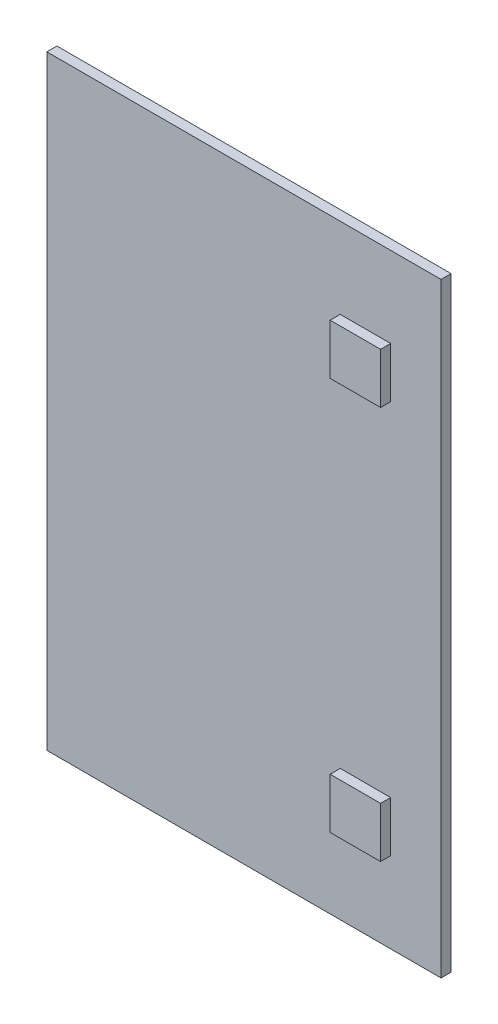
ISO-10303-21;
HEADER;
FILE_DESCRIPTION(('STEP AP214'),'2;1');
FILE_NAME('part.step','',(''),(''),'','','');
FILE_SCHEMA(('AUTOMOTIVE_DESIGN { 1 0 10303 214 1 1 1 1 }'));
ENDSEC;
DATA;
#1=APPLICATION_CONTEXT('core data for automotive mechanical design processes');
#2=APPLICATION_PROTOCOL_DEFINITION('international standard','automotive_design',2000,#1);
#3=PRODUCT_CONTEXT('',#1,'mechanical');
#4=PRODUCT('Part','Part','',(#3));
#5=PRODUCT_RELATED_PRODUCT_CATEGORY('part','',(#4));
#6=PRODUCT_DEFINITION_FORMATION('','',#4);
#7=PRODUCT_DEFINITION_CONTEXT('part definition',#1,'design');
#8=PRODUCT_DEFINITION('design','',#6,#7);
#9=PRODUCT_DEFINITION_SHAPE('','',#8);
#10=(LENGTH_UNIT() NAMED_UNIT(*) SI_UNIT(.MILLI.,.METRE.));
#11=(NAMED_UNIT(*) PLANE_ANGLE_UNIT() SI_UNIT($,.RADIAN.));
#12=(NAMED_UNIT(*) SI_UNIT($,.STERADIAN.) SOLID_ANGLE_UNIT());
#13=UNCERTAINTY_MEASURE_WITH_UNIT(LENGTH_MEASURE(1.E-05),#10,'distance_accuracy_value','');
#14=(GEOMETRIC_REPRESENTATION_CONTEXT(3) GLOBAL_UNCERTAINTY_ASSIGNED_CONTEXT((#13)) GLOBAL_UNIT_ASSIGNED_CONTEXT((#10,
#11,#12)) REPRESENTATION_CONTEXT('',''));
#15=CARTESIAN_POINT('',(0.,0.,0.));
#16=DIRECTION('',(0.,0.,1.));
#17=DIRECTION('',(1.,0.,0.));
#18=AXIS2_PLACEMENT_3D('',#15,#16,#17);
#19=CARTESIAN_POINT('',(0.,0.,0.));
#20=DIRECTION('',(0.,0.,1.));
#21=DIRECTION('',(1.,0.,0.));
#22=AXIS2_PLACEMENT_3D('',#19,#20,#21);
#23=PLANE('',#22);
#24=DIRECTION('',(1.,0.,0.));
#25=VECTOR('',#24,1.);
#26=CARTESIAN_POINT('',(-118.594107130853,469.546616829378,0.));
#27=LINE('',#26,#25);
#28=CARTESIAN_POINT('',(-118.594107130853,469.546616829378,0.));
#29=VERTEX_POINT('',#28);
#30=CARTESIAN_POINT('',(-68.594107130853,469.546616829378,0.));
#31=VERTEX_POINT('',#30);
#32=EDGE_CURVE('E152',#29,#31,#27,.T.);
#33=ORIENTED_EDGE('',*,*,#32,.F.);
#34=DIRECTION('',(0.,-1.,0.));
#35=VECTOR('',#34,1.);
#36=CARTESIAN_POINT('',(-118.594107130853,519.546616829378,0.));
#37=LINE('',#36,#35);
#38=CARTESIAN_POINT('',(-118.594107130853,519.546616829378,0.));
#39=VERTEX_POINT('',#38);
#40=EDGE_CURVE('E149',#39,#29,#37,.T.);
#41=ORIENTED_EDGE('',*,*,#40,.F.);
#42=DIRECTION('',(-1.,0.,0.));
#43=VECTOR('',#42,1.);
#44=CARTESIAN_POINT('',(-118.594107130853,519.546616829378,0.));
#45=LINE('',#44,#43);
#46=CARTESIAN_POINT('',(-68.594107130853,519.546616829378,0.));
#47=VERTEX_POINT('',#46);
#48=EDGE_CURVE('E161',#47,#39,#45,.T.);
#49=ORIENTED_EDGE('',*,*,#48,.F.);
#50=DIRECTION('',(0.,1.,0.));
#51=VECTOR('',#50,1.);
#52=CARTESIAN_POINT('',(-68.594107130853,519.546616829378,0.));
#53=LINE('',#52,#51);
#54=EDGE_CURVE('E169',#31,#47,#53,.T.);
#55=ORIENTED_EDGE('',*,*,#54,.F.);
#56=EDGE_LOOP('',(#33,#41,#49,#55));
#57=FACE_BOUND('',#56,.T.);
#58=DIRECTION('',(0.,1.,0.));
#59=VECTOR('',#58,1.);
#60=CARTESIAN_POINT('',(-18.594107130853,-0.453383170622331,0.));
#61=LINE('',#60,#59);
#62=CARTESIAN_POINT('',(-18.594107130853,-0.453383170622331,0.));
#63=VERTEX_POINT('',#62);
#64=CARTESIAN_POINT('',(-18.594107130853,599.546616829378,0.));
#65=VERTEX_POINT('',#64);
#66=EDGE_CURVE('E180',#63,#65,#61,.T.);
#67=ORIENTED_EDGE('',*,*,#66,.T.);
#68=DIRECTION('',(-1.,0.,0.));
#69=VECTOR('',#68,1.);
#70=CARTESIAN_POINT('',(-18.594107130853,599.546616829378,0.));
#71=LINE('',#70,#69);
#72=CARTESIAN_POINT('',(-409.594107130853,599.546616829378,0.));
#73=VERTEX_POINT('',#72);
#74=EDGE_CURVE('E196',#65,#73,#71,.T.);
#75=ORIENTED_EDGE('',*,*,#74,.T.);
#76=DIRECTION('',(0.,-1.,0.));
#77=VECTOR('',#76,1.);
#78=CARTESIAN_POINT('',(-409.594107130853,-0.453383170622379,0.));
#79=LINE('',#78,#77);
#80=CARTESIAN_POINT('',(-409.594107130853,-0.453383170622379,0.));
#81=VERTEX_POINT('',#80);
#82=EDGE_CURVE('E199',#73,#81,#79,.T.);
#83=ORIENTED_EDGE('',*,*,#82,.T.);
#84=DIRECTION('',(1.,0.,0.));
#85=VECTOR('',#84,1.);
#86=CARTESIAN_POINT('',(-18.594107130853,-0.453383170622331,0.));
#87=LINE('',#86,#85);
#88=EDGE_CURVE('E185',#81,#63,#87,.T.);
#89=ORIENTED_EDGE('',*,*,#88,.T.);
#90=EDGE_LOOP('',(#67,#75,#83,#89));
#91=FACE_BOUND('',#90,.T.);
#92=DIRECTION('',(1.,0.,0.));
#93=VECTOR('',#92,1.);
#94=CARTESIAN_POINT('',(-118.594107130853,79.5466168293776,0.));
#95=LINE('',#94,#93);
#96=CARTESIAN_POINT('',(-118.594107130853,79.5466168293776,0.));
#97=VERTEX_POINT('',#96);
#98=CARTESIAN_POINT('',(-68.5941071308529,79.5466168293776,0.));
#99=VERTEX_POINT('',#98);
#100=EDGE_CURVE('E370',#97,#99,#95,.T.);
#101=ORIENTED_EDGE('',*,*,#100,.F.);
#102=DIRECTION('',(0.,-1.,0.));
#103=VECTOR('',#102,1.);
#104=CARTESIAN_POINT('',(-118.594107130853,129.546616829378,0.));
#105=LINE('',#104,#103);
#106=CARTESIAN_POINT('',(-118.594107130853,129.546616829378,0.));
#107=VERTEX_POINT('',#106);
#108=EDGE_CURVE('E147',#107,#97,#105,.T.);
#109=ORIENTED_EDGE('',*,*,#108,.F.);
#110=DIRECTION('',(-1.,0.,0.));
#111=VECTOR('',#110,1.);
#112=CARTESIAN_POINT('',(-118.594107130853,129.546616829378,0.));
#113=LINE('',#112,#111);
#114=CARTESIAN_POINT('',(-68.5941071308529,129.546616829378,0.));
#115=VERTEX_POINT('',#114);
#116=EDGE_CURVE('E143',#115,#107,#113,.T.);
#117=ORIENTED_EDGE('',*,*,#116,.F.);
#118=DIRECTION('',(0.,1.,0.));
#119=VECTOR('',#118,1.);
#120=CARTESIAN_POINT('',(-68.5941071308529,129.546616829378,0.));
#121=LINE('',#120,#119);
#122=EDGE_CURVE('E367',#99,#115,#121,.T.);
#123=ORIENTED_EDGE('',*,*,#122,.F.);
#124=EDGE_LOOP('',(#101,#109,#117,#123));
#125=FACE_BOUND('',#124,.T.);
#126=ADVANCED_FACE('F33',(#57,#91,#125),#23,.T.);
#127=CARTESIAN_POINT('',(-18.594107130853,-0.453383170622331,-10.));
#128=DIRECTION('',(1.,0.,0.));
#129=DIRECTION('',(0.,0.,-1.));
#130=AXIS2_PLACEMENT_3D('',#127,#128,#129);
#131=PLANE('',#130);
#132=ORIENTED_EDGE('',*,*,#66,.F.);
#133=DIRECTION('',(0.,0.,1.));
#134=VECTOR('',#133,1.);
#135=CARTESIAN_POINT('',(-18.594107130853,-0.453383170622331,-10.));
#136=LINE('',#135,#134);
#137=CARTESIAN_POINT('',(-18.594107130853,-0.453383170622331,-10.));
#138=VERTEX_POINT('',#137);
#139=EDGE_CURVE('E11',#138,#63,#136,.T.);
#140=ORIENTED_EDGE('',*,*,#139,.F.);
#141=DIRECTION('',(0.,1.,0.));
#142=VECTOR('',#141,1.);
#143=CARTESIAN_POINT('',(-18.594107130853,-0.453383170622331,-10.));
#144=LINE('',#143,#142);
#145=CARTESIAN_POINT('',(-18.594107130853,599.546616829378,-10.));
#146=VERTEX_POINT('',#145);
#147=EDGE_CURVE('E181',#138,#146,#144,.T.);
#148=ORIENTED_EDGE('',*,*,#147,.T.);
#149=DIRECTION('',(0.,0.,1.));
#150=VECTOR('',#149,1.);
#151=CARTESIAN_POINT('',(-18.594107130853,599.546616829378,-10.));
#152=LINE('',#151,#150);
#153=EDGE_CURVE('E37',#146,#65,#152,.T.);
#154=ORIENTED_EDGE('',*,*,#153,.T.);
#155=EDGE_LOOP('',(#132,#140,#148,#154));
#156=FACE_BOUND('',#155,.T.);
#157=ADVANCED_FACE('F35',(#156),#131,.T.);
#158=CARTESIAN_POINT('',(-18.594107130853,-0.453383170622331,-10.));
#159=DIRECTION('',(0.,-1.,0.));
#160=DIRECTION('',(1.,0.,0.));
#161=AXIS2_PLACEMENT_3D('',#158,#159,#160);
#162=PLANE('',#161);
#163=ORIENTED_EDGE('',*,*,#88,.F.);
#164=DIRECTION('',(0.,0.,1.));
#165=VECTOR('',#164,1.);
#166=CARTESIAN_POINT('',(-409.594107130853,-0.453383170622379,-10.));
#167=LINE('',#166,#165);
#168=CARTESIAN_POINT('',(-409.594107130853,-0.453383170622379,-10.));
#169=VERTEX_POINT('',#168);
#170=EDGE_CURVE('E42',#169,#81,#167,.T.);
#171=ORIENTED_EDGE('',*,*,#170,.F.);
#172=DIRECTION('',(1.,0.,0.));
#173=VECTOR('',#172,1.);
#174=CARTESIAN_POINT('',(-18.594107130853,-0.453383170622331,-10.));
#175=LINE('',#174,#173);
#176=EDGE_CURVE('E191',#169,#138,#175,.T.);
#177=ORIENTED_EDGE('',*,*,#176,.T.);
#178=ORIENTED_EDGE('',*,*,#139,.T.);
#179=EDGE_LOOP('',(#163,#171,#177,#178));
#180=FACE_BOUND('',#179,.T.);
#181=ADVANCED_FACE('F217',(#180),#162,.T.);
#182=CARTESIAN_POINT('',(-409.594107130853,-0.453383170622379,-10.));
#183=DIRECTION('',(-1.,0.,0.));
#184=DIRECTION('',(0.,-1.,0.));
#185=AXIS2_PLACEMENT_3D('',#182,#183,#184);
#186=PLANE('',#185);
#187=ORIENTED_EDGE('',*,*,#82,.F.);
#188=DIRECTION('',(0.,0.,1.));
#189=VECTOR('',#188,1.);
#190=CARTESIAN_POINT('',(-409.594107130853,599.546616829378,-10.));
#191=LINE('',#190,#189);
#192=CARTESIAN_POINT('',(-409.594107130853,599.546616829378,-10.));
#193=VERTEX_POINT('',#192);
#194=EDGE_CURVE('E204',#193,#73,#191,.T.);
#195=ORIENTED_EDGE('',*,*,#194,.F.);
#196=DIRECTION('',(0.,-1.,0.));
#197=VECTOR('',#196,1.);
#198=CARTESIAN_POINT('',(-409.594107130853,-0.453383170622379,-10.));
#199=LINE('',#198,#197);
#200=EDGE_CURVE('E188',#193,#169,#199,.T.);
#201=ORIENTED_EDGE('',*,*,#200,.T.);
#202=ORIENTED_EDGE('',*,*,#170,.T.);
#203=EDGE_LOOP('',(#187,#195,#201,#202));
#204=FACE_BOUND('',#203,.T.);
#205=ADVANCED_FACE('F223',(#204),#186,.T.);
#206=CARTESIAN_POINT('',(-18.594107130853,599.546616829378,-10.));
#207=DIRECTION('',(0.,1.,0.));
#208=DIRECTION('',(-1.,0.,0.));
#209=AXIS2_PLACEMENT_3D('',#206,#207,#208);
#210=PLANE('',#209);
#211=ORIENTED_EDGE('',*,*,#74,.F.);
#212=ORIENTED_EDGE('',*,*,#153,.F.);
#213=DIRECTION('',(-1.,0.,0.));
#214=VECTOR('',#213,1.);
#215=CARTESIAN_POINT('',(-18.594107130853,599.546616829378,-10.));
#216=LINE('',#215,#214);
#217=EDGE_CURVE('E184',#146,#193,#216,.T.);
#218=ORIENTED_EDGE('',*,*,#217,.T.);
#219=ORIENTED_EDGE('',*,*,#194,.T.);
#220=EDGE_LOOP('',(#211,#212,#218,#219));
#221=FACE_BOUND('',#220,.T.);
#222=ADVANCED_FACE('F212',(#221),#210,.T.);
#223=CARTESIAN_POINT('',(0.,0.,-10.));
#224=DIRECTION('',(0.,0.,1.));
#225=DIRECTION('',(1.,0.,0.));
#226=AXIS2_PLACEMENT_3D('',#223,#224,#225);
#227=PLANE('',#226);
#228=ORIENTED_EDGE('',*,*,#147,.F.);
#229=ORIENTED_EDGE('',*,*,#176,.F.);
#230=ORIENTED_EDGE('',*,*,#200,.F.);
#231=ORIENTED_EDGE('',*,*,#217,.F.);
#232=EDGE_LOOP('',(#228,#229,#230,#231));
#233=FACE_BOUND('',#232,.T.);
#234=ADVANCED_FACE('F220',(#233),#227,.F.);
#235=CARTESIAN_POINT('',(-118.594107130853,519.546616829378,10.));
#236=DIRECTION('',(1.,0.,0.));
#237=DIRECTION('',(0.,0.,-1.));
#238=AXIS2_PLACEMENT_3D('',#235,#236,#237);
#239=PLANE('',#238);
#240=ORIENTED_EDGE('',*,*,#40,.T.);
#241=DIRECTION('',(0.,0.,-1.));
#242=VECTOR('',#241,1.);
#243=CARTESIAN_POINT('',(-118.594107130853,469.546616829378,10.));
#244=LINE('',#243,#242);
#245=CARTESIAN_POINT('',(-118.594107130853,469.546616829378,10.));
#246=VERTEX_POINT('',#245);
#247=EDGE_CURVE('E178',#246,#29,#244,.T.);
#248=ORIENTED_EDGE('',*,*,#247,.F.);
#249=DIRECTION('',(0.,-1.,0.));
#250=VECTOR('',#249,1.);
#251=CARTESIAN_POINT('',(-118.594107130853,519.546616829378,10.));
#252=LINE('',#251,#250);
#253=CARTESIAN_POINT('',(-118.594107130853,519.546616829378,10.));
#254=VERTEX_POINT('',#253);
#255=EDGE_CURVE('E157',#254,#246,#252,.T.);
#256=ORIENTED_EDGE('',*,*,#255,.F.);
#257=DIRECTION('',(0.,0.,-1.));
#258=VECTOR('',#257,1.);
#259=CARTESIAN_POINT('',(-118.594107130853,519.546616829378,10.));
#260=LINE('',#259,#258);
#261=EDGE_CURVE('E166',#254,#39,#260,.T.);
#262=ORIENTED_EDGE('',*,*,#261,.T.);
#263=EDGE_LOOP('',(#240,#248,#256,#262));
#264=FACE_BOUND('',#263,.T.);
#265=ADVANCED_FACE('F243',(#264),#239,.F.);
#266=CARTESIAN_POINT('',(-118.594107130853,469.546616829378,10.));
#267=DIRECTION('',(0.,1.,0.));
#268=DIRECTION('',(-1.,0.,0.));
#269=AXIS2_PLACEMENT_3D('',#266,#267,#268);
#270=PLANE('',#269);
#271=ORIENTED_EDGE('',*,*,#32,.T.);
#272=DIRECTION('',(0.,0.,-1.));
#273=VECTOR('',#272,1.);
#274=CARTESIAN_POINT('',(-68.594107130853,469.546616829378,10.));
#275=LINE('',#274,#273);
#276=CARTESIAN_POINT('',(-68.594107130853,469.546616829378,10.));
#277=VERTEX_POINT('',#276);
#278=EDGE_CURVE('E175',#277,#31,#275,.T.);
#279=ORIENTED_EDGE('',*,*,#278,.F.);
#280=DIRECTION('',(1.,0.,0.));
#281=VECTOR('',#280,1.);
#282=CARTESIAN_POINT('',(-118.594107130853,469.546616829378,10.));
#283=LINE('',#282,#281);
#284=EDGE_CURVE('E160',#246,#277,#283,.T.);
#285=ORIENTED_EDGE('',*,*,#284,.F.);
#286=ORIENTED_EDGE('',*,*,#247,.T.);
#287=EDGE_LOOP('',(#271,#279,#285,#286));
#288=FACE_BOUND('',#287,.T.);
#289=ADVANCED_FACE('F246',(#288),#270,.F.);
#290=CARTESIAN_POINT('',(-68.594107130853,519.546616829378,10.));
#291=DIRECTION('',(-1.,0.,0.));
#292=DIRECTION('',(0.,0.,1.));
#293=AXIS2_PLACEMENT_3D('',#290,#291,#292);
#294=PLANE('',#293);
#295=ORIENTED_EDGE('',*,*,#54,.T.);
#296=DIRECTION('',(0.,0.,-1.));
#297=VECTOR('',#296,1.);
#298=CARTESIAN_POINT('',(-68.594107130853,519.546616829378,10.));
#299=LINE('',#298,#297);
#300=CARTESIAN_POINT('',(-68.594107130853,519.546616829378,10.));
#301=VERTEX_POINT('',#300);
#302=EDGE_CURVE('E58',#301,#47,#299,.T.);
#303=ORIENTED_EDGE('',*,*,#302,.F.);
#304=DIRECTION('',(0.,1.,0.));
#305=VECTOR('',#304,1.);
#306=CARTESIAN_POINT('',(-68.594107130853,519.546616829378,10.));
#307=LINE('',#306,#305);
#308=EDGE_CURVE('E163',#277,#301,#307,.T.);
#309=ORIENTED_EDGE('',*,*,#308,.F.);
#310=ORIENTED_EDGE('',*,*,#278,.T.);
#311=EDGE_LOOP('',(#295,#303,#309,#310));
#312=FACE_BOUND('',#311,.T.);
#313=ADVANCED_FACE('F250',(#312),#294,.F.);
#314=CARTESIAN_POINT('',(-118.594107130853,519.546616829378,10.));
#315=DIRECTION('',(0.,-1.,0.));
#316=DIRECTION('',(0.,0.,-1.));
#317=AXIS2_PLACEMENT_3D('',#314,#315,#316);
#318=PLANE('',#317);
#319=ORIENTED_EDGE('',*,*,#48,.T.);
#320=ORIENTED_EDGE('',*,*,#261,.F.);
#321=DIRECTION('',(-1.,0.,0.));
#322=VECTOR('',#321,1.);
#323=CARTESIAN_POINT('',(-118.594107130853,519.546616829378,10.));
#324=LINE('',#323,#322);
#325=EDGE_CURVE('E165',#301,#254,#324,.T.);
#326=ORIENTED_EDGE('',*,*,#325,.F.);
#327=ORIENTED_EDGE('',*,*,#302,.T.);
#328=EDGE_LOOP('',(#319,#320,#326,#327));
#329=FACE_BOUND('',#328,.T.);
#330=ADVANCED_FACE('F254',(#329),#318,.F.);
#331=CARTESIAN_POINT('',(0.,0.,10.));
#332=DIRECTION('',(0.,0.,1.));
#333=DIRECTION('',(1.,0.,0.));
#334=AXIS2_PLACEMENT_3D('',#331,#332,#333);
#335=PLANE('',#334);
#336=ORIENTED_EDGE('',*,*,#255,.T.);
#337=ORIENTED_EDGE('',*,*,#284,.T.);
#338=ORIENTED_EDGE('',*,*,#308,.T.);
#339=ORIENTED_EDGE('',*,*,#325,.T.);
#340=EDGE_LOOP('',(#336,#337,#338,#339));
#341=FACE_BOUND('',#340,.T.);
#342=ADVANCED_FACE('F258',(#341),#335,.T.);
#343=CARTESIAN_POINT('',(-118.594107130853,129.546616829378,10.));
#344=DIRECTION('',(1.,0.,0.));
#345=DIRECTION('',(0.,0.,-1.));
#346=AXIS2_PLACEMENT_3D('',#343,#344,#345);
#347=PLANE('',#346);
#348=ORIENTED_EDGE('',*,*,#108,.T.);
#349=DIRECTION('',(0.,0.,-1.));
#350=VECTOR('',#349,1.);
#351=CARTESIAN_POINT('',(-118.594107130853,79.5466168293776,10.));
#352=LINE('',#351,#350);
#353=CARTESIAN_POINT('',(-118.594107130853,79.5466168293776,10.));
#354=VERTEX_POINT('',#353);
#355=EDGE_CURVE('E128',#354,#97,#352,.T.);
#356=ORIENTED_EDGE('',*,*,#355,.F.);
#357=DIRECTION('',(0.,-1.,0.));
#358=VECTOR('',#357,1.);
#359=CARTESIAN_POINT('',(-118.594107130853,129.546616829378,10.));
#360=LINE('',#359,#358);
#361=CARTESIAN_POINT('',(-118.594107130853,129.546616829378,10.));
#362=VERTEX_POINT('',#361);
#363=EDGE_CURVE('E135',#362,#354,#360,.T.);
#364=ORIENTED_EDGE('',*,*,#363,.F.);
#365=DIRECTION('',(0.,0.,-1.));
#366=VECTOR('',#365,1.);
#367=CARTESIAN_POINT('',(-118.594107130853,129.546616829378,10.));
#368=LINE('',#367,#366);
#369=EDGE_CURVE('E365',#362,#107,#368,.T.);
#370=ORIENTED_EDGE('',*,*,#369,.T.);
#371=EDGE_LOOP('',(#348,#356,#364,#370));
#372=FACE_BOUND('',#371,.T.);
#373=ADVANCED_FACE('F145',(#372),#347,.F.);
#374=CARTESIAN_POINT('',(-118.594107130853,79.5466168293776,10.));
#375=DIRECTION('',(0.,1.,0.));
#376=DIRECTION('',(0.,0.,1.));
#377=AXIS2_PLACEMENT_3D('',#374,#375,#376);
#378=PLANE('',#377);
#379=ORIENTED_EDGE('',*,*,#100,.T.);
#380=DIRECTION('',(0.,0.,-1.));
#381=VECTOR('',#380,1.);
#382=CARTESIAN_POINT('',(-68.5941071308529,79.5466168293776,10.));
#383=LINE('',#382,#381);
#384=CARTESIAN_POINT('',(-68.5941071308529,79.5466168293776,10.));
#385=VERTEX_POINT('',#384);
#386=EDGE_CURVE('E131',#385,#99,#383,.T.);
#387=ORIENTED_EDGE('',*,*,#386,.F.);
#388=DIRECTION('',(1.,0.,0.));
#389=VECTOR('',#388,1.);
#390=CARTESIAN_POINT('',(-118.594107130853,79.5466168293776,10.));
#391=LINE('',#390,#389);
#392=EDGE_CURVE('E124',#354,#385,#391,.T.);
#393=ORIENTED_EDGE('',*,*,#392,.F.);
#394=ORIENTED_EDGE('',*,*,#355,.T.);
#395=EDGE_LOOP('',(#379,#387,#393,#394));
#396=FACE_BOUND('',#395,.T.);
#397=ADVANCED_FACE('F126',(#396),#378,.F.);
#398=CARTESIAN_POINT('',(-68.5941071308529,129.546616829378,10.));
#399=DIRECTION('',(-1.,0.,0.));
#400=DIRECTION('',(0.,0.,1.));
#401=AXIS2_PLACEMENT_3D('',#398,#399,#400);
#402=PLANE('',#401);
#403=ORIENTED_EDGE('',*,*,#122,.T.);
#404=DIRECTION('',(0.,0.,-1.));
#405=VECTOR('',#404,1.);
#406=CARTESIAN_POINT('',(-68.5941071308529,129.546616829378,10.));
#407=LINE('',#406,#405);
#408=CARTESIAN_POINT('',(-68.5941071308529,129.546616829378,10.));
#409=VERTEX_POINT('',#408);
#410=EDGE_CURVE('E50',#409,#115,#407,.T.);
#411=ORIENTED_EDGE('',*,*,#410,.F.);
#412=DIRECTION('',(0.,1.,0.));
#413=VECTOR('',#412,1.);
#414=CARTESIAN_POINT('',(-68.5941071308529,129.546616829378,10.));
#415=LINE('',#414,#413);
#416=EDGE_CURVE('E134',#385,#409,#415,.T.);
#417=ORIENTED_EDGE('',*,*,#416,.F.);
#418=ORIENTED_EDGE('',*,*,#386,.T.);
#419=EDGE_LOOP('',(#403,#411,#417,#418));
#420=FACE_BOUND('',#419,.T.);
#421=ADVANCED_FACE('F266',(#420),#402,.F.);
#422=CARTESIAN_POINT('',(-118.594107130853,129.546616829378,10.));
#423=DIRECTION('',(0.,-1.,0.));
#424=DIRECTION('',(1.,0.,0.));
#425=AXIS2_PLACEMENT_3D('',#422,#423,#424);
#426=PLANE('',#425);
#427=ORIENTED_EDGE('',*,*,#116,.T.);
#428=ORIENTED_EDGE('',*,*,#369,.F.);
#429=DIRECTION('',(-1.,0.,0.));
#430=VECTOR('',#429,1.);
#431=CARTESIAN_POINT('',(-118.594107130853,129.546616829378,10.));
#432=LINE('',#431,#430);
#433=EDGE_CURVE('E139',#409,#362,#432,.T.);
#434=ORIENTED_EDGE('',*,*,#433,.F.);
#435=ORIENTED_EDGE('',*,*,#410,.T.);
#436=EDGE_LOOP('',(#427,#428,#434,#435));
#437=FACE_BOUND('',#436,.T.);
#438=ADVANCED_FACE('F269',(#437),#426,.F.);
#439=CARTESIAN_POINT('',(0.,0.,10.));
#440=DIRECTION('',(0.,0.,1.));
#441=DIRECTION('',(1.,0.,0.));
#442=AXIS2_PLACEMENT_3D('',#439,#440,#441);
#443=PLANE('',#442);
#444=ORIENTED_EDGE('',*,*,#363,.T.);
#445=ORIENTED_EDGE('',*,*,#392,.T.);
#446=ORIENTED_EDGE('',*,*,#416,.T.);
#447=ORIENTED_EDGE('',*,*,#433,.T.);
#448=EDGE_LOOP('',(#444,#445,#446,#447));
#449=FACE_BOUND('',#448,.T.);
#450=ADVANCED_FACE('F138',(#449),#443,.T.);
#451=CLOSED_SHELL('',(#126,#157,#181,#205,#222,#234,#265,#289,#313,#330,#342,#373,#397,#421,
#438,#450));
#452=MANIFOLD_SOLID_BREP('B2',#451);
#453=ADVANCED_BREP_SHAPE_REPRESENTATION('',(#18,#452),#14);
#454=SHAPE_DEFINITION_REPRESENTATION(#9,#453);
ENDSEC;
END-ISO-10303-21;
